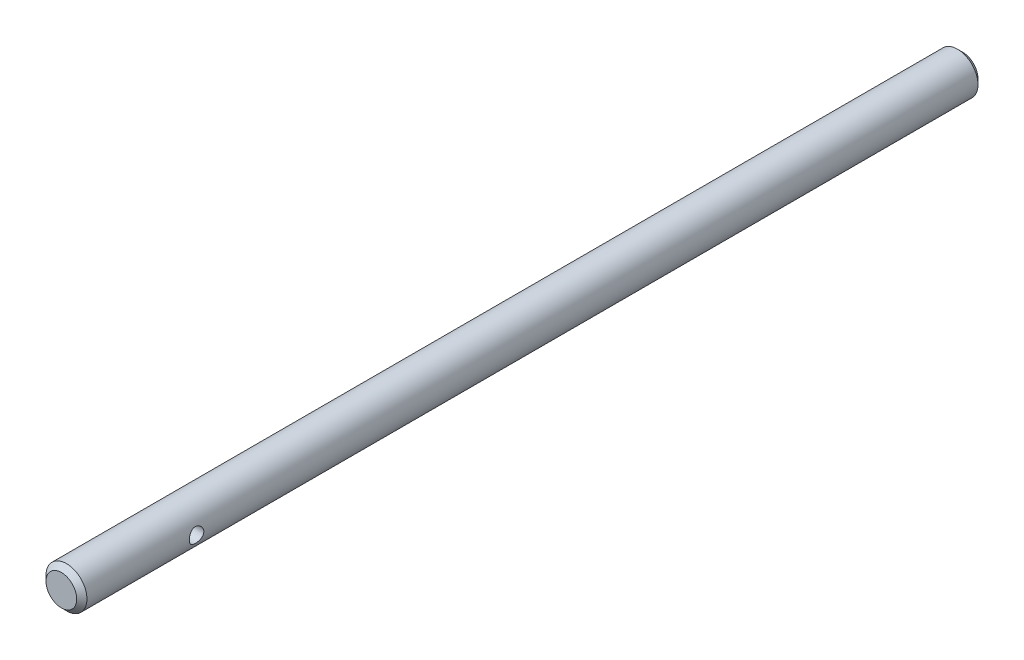
ISO-10303-21;
HEADER;
FILE_DESCRIPTION(('STEP AP214'),'2;1');
FILE_NAME('part.step','',(''),(''),'','','');
FILE_SCHEMA(('AUTOMOTIVE_DESIGN { 1 0 10303 214 1 1 1 1 }'));
ENDSEC;
DATA;
#1=APPLICATION_CONTEXT('core data for automotive mechanical design processes');
#2=APPLICATION_PROTOCOL_DEFINITION('international standard','automotive_design',2000,#1);
#3=PRODUCT_CONTEXT('',#1,'mechanical');
#4=PRODUCT('Part','Part','',(#3));
#5=PRODUCT_RELATED_PRODUCT_CATEGORY('part','',(#4));
#6=PRODUCT_DEFINITION_FORMATION('','',#4);
#7=PRODUCT_DEFINITION_CONTEXT('part definition',#1,'design');
#8=PRODUCT_DEFINITION('design','',#6,#7);
#9=PRODUCT_DEFINITION_SHAPE('','',#8);
#10=(LENGTH_UNIT() NAMED_UNIT(*) SI_UNIT(.MILLI.,.METRE.));
#11=(NAMED_UNIT(*) PLANE_ANGLE_UNIT() SI_UNIT($,.RADIAN.));
#12=(NAMED_UNIT(*) SI_UNIT($,.STERADIAN.) SOLID_ANGLE_UNIT());
#13=UNCERTAINTY_MEASURE_WITH_UNIT(LENGTH_MEASURE(1.E-05),#10,'distance_accuracy_value','');
#14=(GEOMETRIC_REPRESENTATION_CONTEXT(3) GLOBAL_UNCERTAINTY_ASSIGNED_CONTEXT((#13)) GLOBAL_UNIT_ASSIGNED_CONTEXT((#10,
#11,#12)) REPRESENTATION_CONTEXT('',''));
#15=CARTESIAN_POINT('',(0.,0.,0.));
#16=DIRECTION('',(0.,0.,1.));
#17=DIRECTION('',(1.,0.,0.));
#18=AXIS2_PLACEMENT_3D('',#15,#16,#17);
#19=CARTESIAN_POINT('',(0.,0.,-33.3375));
#20=DIRECTION('',(0.,0.,-1.));
#21=DIRECTION('',(0.,1.,0.));
#22=AXIS2_PLACEMENT_3D('',#19,#20,#21);
#23=PLANE('',#22);
#24=CARTESIAN_POINT('',(0.,0.,-33.3375000000729));
#25=DIRECTION('',(0.,0.,1.));
#26=DIRECTION('',(1.,0.,0.));
#27=AXIS2_PLACEMENT_3D('',#24,#25,#26);
#28=CIRCLE('',#27,2.38124999998492);
#29=CARTESIAN_POINT('',(2.3812499999849,0.,-33.3375000000729));
#30=VERTEX_POINT('',#29);
#31=EDGE_CURVE('E57',#30,#30,#28,.T.);
#32=ORIENTED_EDGE('',*,*,#31,.F.);
#33=EDGE_LOOP('',(#32));
#34=FACE_BOUND('',#33,.T.);
#35=ADVANCED_FACE('F32',(#34),#23,.T.);
#36=CARTESIAN_POINT('',(0.,0.,106.3625));
#37=DIRECTION('',(0.,0.,1.));
#38=DIRECTION('',(1.,0.,0.));
#39=AXIS2_PLACEMENT_3D('',#36,#37,#38);
#40=PLANE('',#39);
#41=CARTESIAN_POINT('',(0.,0.,106.362499999989));
#42=DIRECTION('',(0.,0.,-1.));
#43=DIRECTION('',(-1.,0.,0.));
#44=AXIS2_PLACEMENT_3D('',#41,#42,#43);
#45=CIRCLE('',#44,2.3812500000986);
#46=CARTESIAN_POINT('',(-2.38125000009862,0.,106.362499999989));
#47=VERTEX_POINT('',#46);
#48=EDGE_CURVE('E82',#47,#47,#45,.T.);
#49=ORIENTED_EDGE('',*,*,#48,.F.);
#50=EDGE_LOOP('',(#49));
#51=FACE_BOUND('',#50,.T.);
#52=ADVANCED_FACE('F72',(#51),#40,.T.);
#53=CARTESIAN_POINT('',(0.,0.,-32.5437500000021));
#54=DIRECTION('',(0.,0.,1.));
#55=DIRECTION('',(1.,0.,0.));
#56=AXIS2_PLACEMENT_3D('',#53,#54,#55);
#57=CONICAL_SURFACE('',#56,3.17500000005568,0.785398163397448);
#58=ORIENTED_EDGE('',*,*,#31,.T.);
#59=EDGE_LOOP('',(#58));
#60=FACE_BOUND('',#59,.T.);
#61=CARTESIAN_POINT('',(0.,0.,-32.54375));
#62=DIRECTION('',(0.,0.,-1.));
#63=DIRECTION('',(-1.,0.,0.));
#64=AXIS2_PLACEMENT_3D('',#61,#62,#63);
#65=CIRCLE('',#64,3.175);
#66=CARTESIAN_POINT('',(-3.17500000000001,0.,-32.54375));
#67=VERTEX_POINT('',#66);
#68=EDGE_CURVE('E51',#67,#67,#65,.F.);
#69=ORIENTED_EDGE('',*,*,#68,.F.);
#70=EDGE_LOOP('',(#69));
#71=FACE_BOUND('',#70,.T.);
#72=ADVANCED_FACE('F77',(#60,#71),#57,.T.);
#73=CARTESIAN_POINT('',(0.,0.,105.568750000032));
#74=DIRECTION('',(0.,0.,-1.));
#75=DIRECTION('',(-1.,0.,0.));
#76=AXIS2_PLACEMENT_3D('',#73,#74,#75);
#77=CONICAL_SURFACE('',#76,3.17500000005568,0.785398163397448);
#78=CARTESIAN_POINT('',(0.,0.,105.56875));
#79=DIRECTION('',(0.,0.,-1.));
#80=DIRECTION('',(-1.,0.,0.));
#81=AXIS2_PLACEMENT_3D('',#78,#79,#80);
#82=CIRCLE('',#81,3.175);
#83=CARTESIAN_POINT('',(-3.17500000000001,0.,105.56875));
#84=VERTEX_POINT('',#83);
#85=EDGE_CURVE('E47',#84,#84,#82,.T.);
#86=ORIENTED_EDGE('',*,*,#85,.F.);
#87=EDGE_LOOP('',(#86));
#88=FACE_BOUND('',#87,.T.);
#89=ORIENTED_EDGE('',*,*,#48,.T.);
#90=EDGE_LOOP('',(#89));
#91=FACE_BOUND('',#90,.T.);
#92=ADVANCED_FACE('F69',(#88,#91),#77,.T.);
#93=CARTESIAN_POINT('',(0.,0.,106.3625));
#94=DIRECTION('',(0.,0.,-1.));
#95=DIRECTION('',(-1.,0.,0.));
#96=AXIS2_PLACEMENT_3D('',#93,#94,#95);
#97=CYLINDRICAL_SURFACE('',#96,3.175);
#98=CARTESIAN_POINT('',(-3.17500000000001,4.53003928154677E-13,87.4522000000012));
#99=CARTESIAN_POINT('',(-3.17500087649079,-0.0614285544762226,87.4521987762438));
#100=CARTESIAN_POINT('',(-3.17320130070147,-0.122848391480431,87.4572236789844));
#101=CARTESIAN_POINT('',(-3.16620100342015,-0.243864611741924,87.477118585437));
#102=CARTESIAN_POINT('',(-3.1610003885693,-0.303461052111324,87.4919882804612));
#103=CARTESIAN_POINT('',(-3.14775949893744,-0.419068309150584,87.5309884499734));
#104=CARTESIAN_POINT('',(-3.13972436624617,-0.475085403185515,87.5551021617429));
#105=CARTESIAN_POINT('',(-3.12162393487067,-0.582278041616042,87.6118250401236));
#106=CARTESIAN_POINT('',(-3.11155815385683,-0.633452431498185,87.6444362256344));
#107=CARTESIAN_POINT('',(-3.09000790855608,-0.731495005229558,87.7185550799277));
#108=CARTESIAN_POINT('',(-3.07848610582599,-0.778149616243425,87.7603343168998));
#109=CARTESIAN_POINT('',(-3.05551603179215,-0.863958107942185,87.8510265413096));
#110=CARTESIAN_POINT('',(-3.0440677806532,-0.903110009958216,87.8999414046325));
#111=CARTESIAN_POINT('',(-3.02211785986242,-0.974093633831883,88.0055256901782));
#112=CARTESIAN_POINT('',(-3.01166094904203,-1.00563502809049,88.0624005183345));
#113=CARTESIAN_POINT('',(-2.99345244738729,-1.05861134705863,88.1810793976011));
#114=CARTESIAN_POINT('',(-2.98569989720808,-1.08004985661432,88.2428816911647));
#115=CARTESIAN_POINT('',(-2.97417421737159,-1.11138819305235,88.3672149448503));
#116=CARTESIAN_POINT('',(-2.97026214805198,-1.12169236541634,88.4296306997851));
#117=CARTESIAN_POINT('',(-2.96645158379275,-1.13173392893159,88.5554184785965));
#118=CARTESIAN_POINT('',(-2.96655163468306,-1.1314751485642,88.6187901476828));
#119=CARTESIAN_POINT('',(-2.97063328242043,-1.12070953557232,88.741113366103));
#120=CARTESIAN_POINT('',(-2.97440855232938,-1.11074743190136,88.800120979115));
#121=CARTESIAN_POINT('',(-2.9850748398769,-1.08175290027479,88.9155646424105));
#122=CARTESIAN_POINT('',(-2.9919662804764,-1.06271924100902,88.9720003424608));
#123=CARTESIAN_POINT('',(-3.0082231181811,-1.01579639288419,89.0818676232972));
#124=CARTESIAN_POINT('',(-3.01763009039338,-0.98775662564091,89.1352284735385));
#125=CARTESIAN_POINT('',(-3.03784253722592,-0.923722187948017,89.2366522607272));
#126=CARTESIAN_POINT('',(-3.04864845894013,-0.887724971742911,89.284713494824));
#127=CARTESIAN_POINT('',(-3.07123422850194,-0.806247147627191,89.3772112249125));
#128=CARTESIAN_POINT('',(-3.08303358094086,-0.760326653484963,89.4212563554344));
#129=CARTESIAN_POINT('',(-3.10571393948953,-0.661610098844489,89.5011304069042));
#130=CARTESIAN_POINT('',(-3.11659483086983,-0.608813181467274,89.5369583023543));
#131=CARTESIAN_POINT('',(-3.13639217173455,-0.496923650489948,89.5997564387677));
#132=CARTESIAN_POINT('',(-3.14528190725232,-0.437759573780687,89.6266083627391));
#133=CARTESIAN_POINT('',(-3.15989936928583,-0.315359989841495,89.6698520019216));
#134=CARTESIAN_POINT('',(-3.16562835574333,-0.252126116159825,89.6862478855396));
#135=CARTESIAN_POINT('',(-3.17306329879333,-0.126684885961258,89.7073894892915));
#136=CARTESIAN_POINT('',(-3.17495136824999,-0.0645771816877637,89.7126630443393));
#137=CARTESIAN_POINT('',(-3.1750467253115,0.0596565359681413,89.7129316004246));
#138=CARTESIAN_POINT('',(-3.1732547352019,0.121782543365313,89.7079286184386));
#139=CARTESIAN_POINT('',(-3.16631168752831,0.242087689559936,89.6881955525588));
#140=CARTESIAN_POINT('',(-3.16127656517539,0.300329231110843,89.6738009768785));
#141=CARTESIAN_POINT('',(-3.14846933320474,0.413538192846929,89.6361245839312));
#142=CARTESIAN_POINT('',(-3.1406968683865,0.468505187040557,89.6128416132634));
#143=CARTESIAN_POINT('',(-3.12292068057339,0.57533272547152,89.5573310976335));
#144=CARTESIAN_POINT('',(-3.11286035066919,0.627062417893911,89.5248703998222));
#145=CARTESIAN_POINT('',(-3.09163517782228,0.724505279210692,89.452193926259));
#146=CARTESIAN_POINT('',(-3.08046995852095,0.770216385551117,89.4119755035335));
#147=CARTESIAN_POINT('',(-3.05754963314872,0.856811848575935,89.3224515863602));
#148=CARTESIAN_POINT('',(-3.04579412439928,0.897320261232352,89.2727816248861));
#149=CARTESIAN_POINT('',(-3.02359841598833,0.969488296473609,89.1671058873449));
#150=CARTESIAN_POINT('',(-3.01315827754045,1.00114750732499,89.1110998166433));
#151=CARTESIAN_POINT('',(-2.99485112677027,1.05465477079474,88.9941072630932));
#152=CARTESIAN_POINT('',(-2.98698641696926,1.07649405053068,88.9331163841887));
#153=CARTESIAN_POINT('',(-2.97489781303411,1.10946944902904,88.8079703660609));
#154=CARTESIAN_POINT('',(-2.97067196334791,1.12061131703534,88.7438169460358));
#155=CARTESIAN_POINT('',(-2.96658222044331,1.13139068963565,88.6181943439534));
#156=CARTESIAN_POINT('',(-2.96647835747844,1.13166111008697,88.556786759525));
#157=CARTESIAN_POINT('',(-2.97003931415363,1.12228164306466,88.4348511176468));
#158=CARTESIAN_POINT('',(-2.97370384428682,1.11263251766035,88.3743229929947));
#159=CARTESIAN_POINT('',(-2.9841983947587,1.08416089230599,88.2573729488087));
#160=CARTESIAN_POINT('',(-2.99094779649665,1.06557142470592,88.2008864686868));
#161=CARTESIAN_POINT('',(-3.00681233111046,1.01994372799999,88.0917954076773));
#162=CARTESIAN_POINT('',(-3.01592803119448,0.992903472900002,88.0391917614036));
#163=CARTESIAN_POINT('',(-3.03604854272451,0.929616151238919,87.9365905113258));
#164=CARTESIAN_POINT('',(-3.04712352240678,0.892986233527237,87.886842951153));
#165=CARTESIAN_POINT('',(-3.06964995874734,0.812177154253006,87.7939972925654));
#166=CARTESIAN_POINT('',(-3.08110152803625,0.767995717285952,87.7509012058257));
#167=CARTESIAN_POINT('',(-3.10373428576564,0.670861718734214,87.6705364212021));
#168=CARTESIAN_POINT('',(-3.11487776157134,0.617595515492769,87.6336346678272));
#169=CARTESIAN_POINT('',(-3.13506244460871,0.505234578584543,87.5693345117907));
#170=CARTESIAN_POINT('',(-3.14410383031934,0.44614034035706,87.5419353022139));
#171=CARTESIAN_POINT('',(-3.15906443826102,0.323645197028339,87.4975664991758));
#172=CARTESIAN_POINT('',(-3.16497811106265,0.260236860921859,87.4806154348678));
#173=CARTESIAN_POINT('',(-3.17294468299437,0.13121513161309,87.4579349922863));
#174=CARTESIAN_POINT('',(-3.17499906395213,0.0656025945976862,87.4522013069124));
#175=CARTESIAN_POINT('',(-3.17500000000001,4.53003928154677E-13,87.4522000000012));
#176=B_SPLINE_CURVE_WITH_KNOTS('',3,(#98,#99,#100,#101,#102,#103,#104,#105,#106,#107,#108,#109,
#110,#111,#112,#113,#114,#115,#116,#117,#118,#119,#120,#121,#122,#123,#124,#125,#126,#127,#128,
#129,#130,#131,#132,#133,#134,#135,#136,#137,#138,#139,#140,#141,#142,#143,#144,#145,#146,#147,
#148,#149,#150,#151,#152,#153,#154,#155,#156,#157,#158,#159,#160,#161,#162,#163,#164,#165,#166,
#167,#168,#169,#170,#171,#172,#173,#174,#175),.UNSPECIFIED.,.T.,.F.,(4,2,2,2,2,2,2,2,2,2,2,2,2,
2,2,2,2,2,2,2,2,2,2,2,2,2,2,2,2,2,2,2,2,2,2,2,2,2,4),(0.,0.184043941459553,0.368082112412791,
0.551788122807069,0.735537819443336,0.925722644883159,1.11595755842544,1.31258758821642,
1.50914779437029,1.69830149435239,1.88738663727467,2.06643452933672,2.2455067310446,
2.42774410221582,2.61003985955343,2.80329006106034,2.99656436677719,3.19229416831939,
3.38794589132543,3.5740818703276,3.76018131989981,3.93997181359119,4.1197856456925,
4.30465683345386,4.48959121210521,4.68416822385528,4.87875428732963,5.07351384543871,
5.2681686727911,5.45147357003612,5.63476438593094,5.81351722268539,5.99231294661067,
6.1797782600349,6.3673001599319,6.56359488860393,6.75987294468703,6.95649809396622,
7.15304773089822),.UNSPECIFIED.);
#177=CARTESIAN_POINT('',(-3.17500000000001,4.53003928154677E-13,87.4522000000012));
#178=VERTEX_POINT('',#177);
#179=EDGE_CURVE('E10',#178,#178,#176,.T.);
#180=ORIENTED_EDGE('',*,*,#179,.F.);
#181=EDGE_LOOP('',(#180));
#182=FACE_BOUND('',#181,.T.);
#183=CARTESIAN_POINT('',(3.17499999999999,0.,87.4522000000012));
#184=CARTESIAN_POINT('',(3.17500087649075,0.0614285544766757,87.4521987762438));
#185=CARTESIAN_POINT('',(3.17320130070142,0.122848391480885,87.4572236789843));
#186=CARTESIAN_POINT('',(3.16620100342008,0.243864611742387,87.4771185854369));
#187=CARTESIAN_POINT('',(3.16100038856923,0.303461052111793,87.4919882804611));
#188=CARTESIAN_POINT('',(3.14775949893735,0.419068309151069,87.5309884499732));
#189=CARTESIAN_POINT('',(3.13972436624607,0.475085403186009,87.5551021617427));
#190=CARTESIAN_POINT('',(3.12162393487055,0.582278041616558,87.6118250401234));
#191=CARTESIAN_POINT('',(3.1115581538567,0.633452431498713,87.6444362256342));
#192=CARTESIAN_POINT('',(3.09000790855592,0.731495005230114,87.7185550799274));
#193=CARTESIAN_POINT('',(3.07848610582581,0.778149616243996,87.7603343168995));
#194=CARTESIAN_POINT('',(3.05551603179195,0.863958107942792,87.8510265413092));
#195=CARTESIAN_POINT('',(3.04406778065299,0.903110009958843,87.8999414046321));
#196=CARTESIAN_POINT('',(3.02211785986218,0.974093633832552,88.0055256901778));
#197=CARTESIAN_POINT('',(3.01166094904178,1.00563502809118,88.0624005183341));
#198=CARTESIAN_POINT('',(2.993452447387,1.05861134705937,88.1810793976006));
#199=CARTESIAN_POINT('',(2.98569989720777,1.08004985661509,88.2428816911643));
#200=CARTESIAN_POINT('',(2.97417421737125,1.11138819305318,88.3672149448499));
#201=CARTESIAN_POINT('',(2.97026214805163,1.12169236541719,88.4296306997847));
#202=CARTESIAN_POINT('',(2.96645158379238,1.13173392893248,88.5554184785961));
#203=CARTESIAN_POINT('',(2.96655163468268,1.13147514856512,88.6187901476824));
#204=CARTESIAN_POINT('',(2.97063328242004,1.12070953557329,88.7411133661026));
#205=CARTESIAN_POINT('',(2.97440855232899,1.11074743190234,88.8001209791146));
#206=CARTESIAN_POINT('',(2.9850748398765,1.08175290027582,88.9155646424101));
#207=CARTESIAN_POINT('',(2.99196628047599,1.06271924101008,88.9720003424603));
#208=CARTESIAN_POINT('',(3.00822311818069,1.0157963928853,89.0818676232967));
#209=CARTESIAN_POINT('',(3.01763009039298,0.987756625642052,89.1352284735381));
#210=CARTESIAN_POINT('',(3.03784253722553,0.923722187949212,89.2366522607268));
#211=CARTESIAN_POINT('',(3.04864845893975,0.887724971744132,89.2847134948236));
#212=CARTESIAN_POINT('',(3.07123422850157,0.806247147628463,89.3772112249121));
#213=CARTESIAN_POINT('',(3.08303358094051,0.760326653486257,89.421256355434));
#214=CARTESIAN_POINT('',(3.10571393948921,0.661610098845828,89.5011304069039));
#215=CARTESIAN_POINT('',(3.11659483086954,0.608813181468634,89.536958302354));
#216=CARTESIAN_POINT('',(3.1363921717343,0.496923650491341,89.5997564387674));
#217=CARTESIAN_POINT('',(3.1452819072521,0.437759573782092,89.6266083627389));
#218=CARTESIAN_POINT('',(3.15989936928566,0.315359989842916,89.6698520019215));
#219=CARTESIAN_POINT('',(3.16562835574319,0.25212611616125,89.6862478855394));
#220=CARTESIAN_POINT('',(3.17306329879324,0.126684885962677,89.7073894892915));
#221=CARTESIAN_POINT('',(3.17495136824993,0.0645771816891725,89.7126630443393));
#222=CARTESIAN_POINT('',(3.1750467253115,-0.0596565359667561,89.7129316004246));
#223=CARTESIAN_POINT('',(3.17325473520192,-0.121782543363942,89.7079286184386));
#224=CARTESIAN_POINT('',(3.16631168752839,-0.242087689558589,89.6881955525589));
#225=CARTESIAN_POINT('',(3.16127656517549,-0.300329231109507,89.6738009768787));
#226=CARTESIAN_POINT('',(3.14846933320489,-0.413538192845614,89.6361245839314));
#227=CARTESIAN_POINT('',(3.14069686838667,-0.468505187039253,89.6128416132636));
#228=CARTESIAN_POINT('',(3.1229206805736,-0.575332725470242,89.5573310976337));
#229=CARTESIAN_POINT('',(3.11286035066942,-0.627062417892649,89.5248703998225));
#230=CARTESIAN_POINT('',(3.09163517782255,-0.724505279209447,89.4521939262593));
#231=CARTESIAN_POINT('',(3.08046995852123,-0.770216385549875,89.4119755035338));
#232=CARTESIAN_POINT('',(3.05754963314904,-0.856811848574717,89.3224515863605));
#233=CARTESIAN_POINT('',(3.04579412439961,-0.897320261231158,89.2727816248865));
#234=CARTESIAN_POINT('',(3.02359841598867,-0.969488296472454,89.1671058873454));
#235=CARTESIAN_POINT('',(3.0131582775408,-1.00114750732385,89.1110998166437));
#236=CARTESIAN_POINT('',(2.99485112677062,-1.05465477079365,88.9941072630936));
#237=CARTESIAN_POINT('',(2.98698641696962,-1.07649405052962,88.9331163841892));
#238=CARTESIAN_POINT('',(2.97489781303445,-1.10946944902804,88.8079703660614));
#239=CARTESIAN_POINT('',(2.97067196334825,-1.12061131703436,88.7438169460363));
#240=CARTESIAN_POINT('',(2.96658222044363,-1.13139068963473,88.6181943439539));
#241=CARTESIAN_POINT('',(2.96647835747875,-1.13166111008608,88.5567867595255));
#242=CARTESIAN_POINT('',(2.97003931415392,-1.12228164306382,88.4348511176473));
#243=CARTESIAN_POINT('',(2.9737038442871,-1.11263251765953,88.3743229929952));
#244=CARTESIAN_POINT('',(2.98419839475896,-1.08416089230522,88.2573729488091));
#245=CARTESIAN_POINT('',(2.99094779649689,-1.06557142470516,88.2008864686873));
#246=CARTESIAN_POINT('',(3.00681233111068,-1.01994372799927,88.0917954076777));
#247=CARTESIAN_POINT('',(3.01592803119469,-0.9929034728993,88.039191761404));
#248=CARTESIAN_POINT('',(3.03604854272468,-0.929616151238251,87.9365905113262));
#249=CARTESIAN_POINT('',(3.04712352240694,-0.892986233526582,87.8868429511533));
#250=CARTESIAN_POINT('',(3.06964995874747,-0.812177154252383,87.7939972925656));
#251=CARTESIAN_POINT('',(3.08110152803637,-0.767995717285348,87.750901205826));
#252=CARTESIAN_POINT('',(3.10373428576573,-0.670861718733642,87.6705364212024));
#253=CARTESIAN_POINT('',(3.11487776157142,-0.617595515492207,87.6336346678275));
#254=CARTESIAN_POINT('',(3.13506244460877,-0.505234578584004,87.5693345117909));
#255=CARTESIAN_POINT('',(3.14410383031938,-0.446140340356535,87.541935302214));
#256=CARTESIAN_POINT('',(3.15906443826104,-0.323645197027838,87.4975664991759));
#257=CARTESIAN_POINT('',(3.16497811106266,-0.26023686092137,87.4806154348679));
#258=CARTESIAN_POINT('',(3.17294468299436,-0.131215131612621,87.4579349922864));
#259=CARTESIAN_POINT('',(3.17499906395211,-0.065602594597226,87.4522013069124));
#260=CARTESIAN_POINT('',(3.17499999999999,0.,87.4522000000012));
#261=B_SPLINE_CURVE_WITH_KNOTS('',3,(#183,#184,#185,#186,#187,#188,#189,#190,#191,#192,#193,
#194,#195,#196,#197,#198,#199,#200,#201,#202,#203,#204,#205,#206,#207,#208,#209,#210,#211,#212,
#213,#214,#215,#216,#217,#218,#219,#220,#221,#222,#223,#224,#225,#226,#227,#228,#229,#230,#231,
#232,#233,#234,#235,#236,#237,#238,#239,#240,#241,#242,#243,#244,#245,#246,#247,#248,#249,#250,
#251,#252,#253,#254,#255,#256,#257,#258,#259,#260),.UNSPECIFIED.,.T.,.F.,(4,2,2,2,2,2,2,2,2,2,2,
2,2,2,2,2,2,2,2,2,2,2,2,2,2,2,2,2,2,2,2,2,2,2,2,2,2,2,4),(0.,0.184043941459553,
0.368082112412795,0.551788122807076,0.735537819443341,0.925722644883171,1.11595755842545,
1.31258758821644,1.50914779437033,1.69830149435246,1.88738663727476,2.06643452933681,
2.24550673104462,2.42774410221582,2.61003985955341,2.80329006106031,2.99656436677717,
3.19229416831938,3.38794589132544,3.57408187032765,3.76018131989989,3.93997181359127,
4.11978564569258,4.30465683345394,4.48959121210524,4.68416822385528,4.87875428732961,
5.0735138454387,5.26816867279107,5.45147357003611,5.63476438593097,5.81351722268545,
5.99231294661072,6.17977826003497,6.36730015993194,6.56359488860397,6.75987294468707,
6.95649809396624,7.15304773089821),.UNSPECIFIED.);
#262=CARTESIAN_POINT('',(3.17499999999999,0.,87.4522000000012));
#263=VERTEX_POINT('',#262);
#264=EDGE_CURVE('E43',#263,#263,#261,.T.);
#265=ORIENTED_EDGE('',*,*,#264,.F.);
#266=EDGE_LOOP('',(#265));
#267=FACE_BOUND('',#266,.T.);
#268=ORIENTED_EDGE('',*,*,#85,.T.);
#269=EDGE_LOOP('',(#268));
#270=FACE_BOUND('',#269,.T.);
#271=ORIENTED_EDGE('',*,*,#68,.T.);
#272=EDGE_LOOP('',(#271));
#273=FACE_BOUND('',#272,.T.);
#274=ADVANCED_FACE('F59',(#182,#267,#270,#273),#97,.T.);
#275=CARTESIAN_POINT('',(3.17499999999999,4.53003928154677E-13,88.5825000000012));
#276=DIRECTION('',(1.,0.,0.));
#277=DIRECTION('',(0.,0.,-1.));
#278=AXIS2_PLACEMENT_3D('',#275,#276,#277);
#279=CYLINDRICAL_SURFACE('',#278,1.13029999999999);
#280=ORIENTED_EDGE('',*,*,#179,.T.);
#281=EDGE_LOOP('',(#280));
#282=FACE_BOUND('',#281,.T.);
#283=ORIENTED_EDGE('',*,*,#264,.T.);
#284=EDGE_LOOP('',(#283));
#285=FACE_BOUND('',#284,.T.);
#286=ADVANCED_FACE('F62',(#282,#285),#279,.F.);
#287=CLOSED_SHELL('',(#35,#52,#72,#92,#274,#286));
#288=MANIFOLD_SOLID_BREP('B2',#287);
#289=ADVANCED_BREP_SHAPE_REPRESENTATION('',(#18,#288),#14);
#290=SHAPE_DEFINITION_REPRESENTATION(#9,#289);
ENDSEC;
END-ISO-10303-21;
